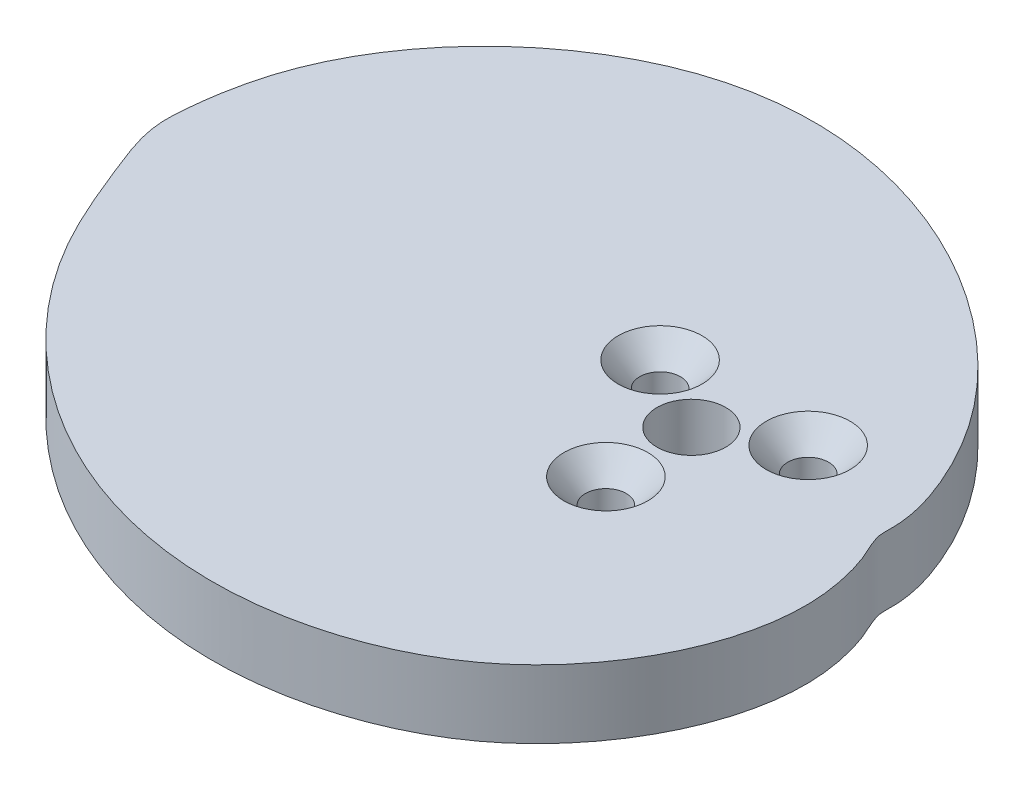
ISO-10303-21;
HEADER;
FILE_DESCRIPTION(('STEP AP214'),'2;1');
FILE_NAME('part.step','',(''),(''),'','','');
FILE_SCHEMA(('AUTOMOTIVE_DESIGN { 1 0 10303 214 1 1 1 1 }'));
ENDSEC;
DATA;
#1=APPLICATION_CONTEXT('core data for automotive mechanical design processes');
#2=APPLICATION_PROTOCOL_DEFINITION('international standard','automotive_design',2000,#1);
#3=PRODUCT_CONTEXT('',#1,'mechanical');
#4=PRODUCT('Part','Part','',(#3));
#5=PRODUCT_RELATED_PRODUCT_CATEGORY('part','',(#4));
#6=PRODUCT_DEFINITION_FORMATION('','',#4);
#7=PRODUCT_DEFINITION_CONTEXT('part definition',#1,'design');
#8=PRODUCT_DEFINITION('design','',#6,#7);
#9=PRODUCT_DEFINITION_SHAPE('','',#8);
#10=(LENGTH_UNIT() NAMED_UNIT(*) SI_UNIT(.MILLI.,.METRE.));
#11=(NAMED_UNIT(*) PLANE_ANGLE_UNIT() SI_UNIT($,.RADIAN.));
#12=(NAMED_UNIT(*) SI_UNIT($,.STERADIAN.) SOLID_ANGLE_UNIT());
#13=UNCERTAINTY_MEASURE_WITH_UNIT(LENGTH_MEASURE(1.E-05),#10,'distance_accuracy_value','');
#14=(GEOMETRIC_REPRESENTATION_CONTEXT(3) GLOBAL_UNCERTAINTY_ASSIGNED_CONTEXT((#13)) GLOBAL_UNIT_ASSIGNED_CONTEXT((#10,
#11,#12)) REPRESENTATION_CONTEXT('',''));
#15=CARTESIAN_POINT('',(0.,0.,0.));
#16=DIRECTION('',(0.,0.,1.));
#17=DIRECTION('',(1.,0.,0.));
#18=AXIS2_PLACEMENT_3D('',#15,#16,#17);
#19=CARTESIAN_POINT('',(-49.2125,3.175,0.));
#20=CARTESIAN_POINT('',(-49.1280004522732,3.175,1.90065792244172));
#21=CARTESIAN_POINT('',(-47.2540880933168,3.175,6.66413931437912));
#22=CARTESIAN_POINT('',(-42.8137329290288,3.175,17.6519170990426));
#23=CARTESIAN_POINT('',(-32.4859044128174,3.175,28.3387478991766));
#24=CARTESIAN_POINT('',(-19.3602400724952,3.175,33.9238641874124));
#25=CARTESIAN_POINT('',(-8.09712221959227,3.175,35.2466834780568));
#26=CARTESIAN_POINT('',(1.97885603914673,3.175,33.1837377459548));
#27=CARTESIAN_POINT('',(14.4173503802399,3.175,26.069147011578));
#28=CARTESIAN_POINT('',(20.8605641593018,3.175,13.8730576240785));
#29=CARTESIAN_POINT('',(19.2298151188731,3.175,4.80400336499832));
#30=CARTESIAN_POINT('',(18.5124860413441,3.175,2.55273845925311));
#31=CARTESIAN_POINT('',(17.8763525323498,3.175,1.26450673972017));
#32=CARTESIAN_POINT('',(17.3725445314869,3.175,-0.0262618883752947));
#33=CARTESIAN_POINT('',(17.5387463582876,3.175,-2.77335367017557));
#34=CARTESIAN_POINT('',(15.3191005053765,3.175,-10.0958942570277));
#35=CARTESIAN_POINT('',(4.81220487085529,3.175,-24.3071562403967));
#36=CARTESIAN_POINT('',(-14.6307156412061,3.175,-32.4629501155169));
#37=CARTESIAN_POINT('',(-35.6233493287113,3.175,-27.0074534795134));
#38=CARTESIAN_POINT('',(-46.9443759457376,3.175,-15.5950187741105));
#39=CARTESIAN_POINT('',(-49.0541571441806,3.175,-3.93180987345028));
#40=CARTESIAN_POINT('',(-49.2376521491179,3.175,-0.565750146284187));
#41=CARTESIAN_POINT('',(-49.2125,3.175,0.));
#42=B_SPLINE_CURVE_WITH_KNOTS('',3,(#19,#20,#21,#22,#23,#24,#25,#26,#27,#28,#29,#30,#31,#32,#33,
#34,#35,#36,#37,#38,#39,#40,#41),.UNSPECIFIED.,.T.,.F.,(4,1,1,1,1,1,1,1,1,1,1,1,1,1,1,1,1,1,1,1,
4),(0.,0.0279663967486096,0.0727600277481674,0.174313521559716,0.233184530112514,
0.278568108071313,0.338287208861123,0.379399608651692,0.487460722085829,0.506184645964242,
0.5132969846917,0.521874876340379,0.527253150289611,0.53321404670607,0.561507576476801,
0.636427649518343,0.787871295231716,0.828053444880665,0.951006716045295,0.991675517795837,1.),.UNSPECIFIED.);
#43=DIRECTION('',(0.,-1.,0.));
#44=VECTOR('',#43,1.);
#45=SURFACE_OF_LINEAR_EXTRUSION('',#42,#44);
#46=CARTESIAN_POINT('',(-49.2125,3.175,0.));
#47=VERTEX_POINT('',#46);
#48=EDGE_CURVE('E10',#47,#47,#42,.T.);
#49=ORIENTED_EDGE('',*,*,#48,.F.);
#50=EDGE_LOOP('',(#49));
#51=FACE_BOUND('',#50,.T.);
#52=CARTESIAN_POINT('',(-49.2125,-3.175,0.));
#53=CARTESIAN_POINT('',(-49.1280004522732,-3.175,1.90065792244172));
#54=CARTESIAN_POINT('',(-47.2540880933168,-3.175,6.66413931437912));
#55=CARTESIAN_POINT('',(-42.8137329290288,-3.175,17.6519170990426));
#56=CARTESIAN_POINT('',(-32.4859044128174,-3.175,28.3387478991766));
#57=CARTESIAN_POINT('',(-19.3602400724952,-3.175,33.9238641874124));
#58=CARTESIAN_POINT('',(-8.09712221959227,-3.175,35.2466834780568));
#59=CARTESIAN_POINT('',(1.97885603914673,-3.175,33.1837377459548));
#60=CARTESIAN_POINT('',(14.4173503802399,-3.175,26.069147011578));
#61=CARTESIAN_POINT('',(20.8605641593018,-3.175,13.8730576240785));
#62=CARTESIAN_POINT('',(19.2298151188731,-3.175,4.80400336499832));
#63=CARTESIAN_POINT('',(18.5124860413441,-3.175,2.55273845925311));
#64=CARTESIAN_POINT('',(17.8763525323498,-3.175,1.26450673972017));
#65=CARTESIAN_POINT('',(17.3725445314869,-3.175,-0.0262618883752947));
#66=CARTESIAN_POINT('',(17.5387463582876,-3.175,-2.77335367017557));
#67=CARTESIAN_POINT('',(15.3191005053765,-3.175,-10.0958942570277));
#68=CARTESIAN_POINT('',(4.81220487085529,-3.175,-24.3071562403967));
#69=CARTESIAN_POINT('',(-14.6307156412061,-3.175,-32.4629501155169));
#70=CARTESIAN_POINT('',(-35.6233493287113,-3.175,-27.0074534795134));
#71=CARTESIAN_POINT('',(-46.9443759457376,-3.175,-15.5950187741105));
#72=CARTESIAN_POINT('',(-49.0541571441806,-3.175,-3.93180987345028));
#73=CARTESIAN_POINT('',(-49.2376521491179,-3.175,-0.565750146284187));
#74=CARTESIAN_POINT('',(-49.2125,-3.175,0.));
#75=B_SPLINE_CURVE_WITH_KNOTS('',3,(#52,#53,#54,#55,#56,#57,#58,#59,#60,#61,#62,#63,#64,#65,#66,
#67,#68,#69,#70,#71,#72,#73,#74),.UNSPECIFIED.,.T.,.F.,(4,1,1,1,1,1,1,1,1,1,1,1,1,1,1,1,1,1,1,1,
4),(0.,0.0279663967486096,0.0727600277481674,0.174313521559716,0.233184530112514,
0.278568108071313,0.338287208861123,0.379399608651692,0.487460722085829,0.506184645964242,
0.5132969846917,0.521874876340379,0.527253150289611,0.53321404670607,0.561507576476801,
0.636427649518343,0.787871295231716,0.828053444880665,0.951006716045295,0.991675517795837,1.),.UNSPECIFIED.);
#76=CARTESIAN_POINT('',(-49.2125,-3.175,0.));
#77=VERTEX_POINT('',#76);
#78=EDGE_CURVE('E55',#77,#77,#75,.T.);
#79=ORIENTED_EDGE('',*,*,#78,.T.);
#80=EDGE_LOOP('',(#79));
#81=FACE_BOUND('',#80,.T.);
#82=ADVANCED_FACE('F51',(#51,#81),#45,.F.);
#83=CARTESIAN_POINT('',(19.2740141783279,3.175,5.28414083663297));
#84=DIRECTION('',(0.,1.,0.));
#85=DIRECTION('',(0.,0.,1.));
#86=AXIS2_PLACEMENT_3D('',#83,#84,#85);
#87=PLANE('',#86);
#88=CARTESIAN_POINT('',(0.,3.175,7.95020000000001));
#89=DIRECTION('',(0.,1.,0.));
#90=DIRECTION('',(0.,0.,1.));
#91=AXIS2_PLACEMENT_3D('',#88,#89,#90);
#92=CIRCLE('',#91,3.8989);
#93=CARTESIAN_POINT('',(0.,3.175,11.8491));
#94=VERTEX_POINT('',#93);
#95=EDGE_CURVE('E112',#94,#94,#92,.T.);
#96=ORIENTED_EDGE('',*,*,#95,.F.);
#97=EDGE_LOOP('',(#96));
#98=FACE_BOUND('',#97,.T.);
#99=CARTESIAN_POINT('',(6.88507516516696,3.175,-3.97510000000014));
#100=DIRECTION('',(0.,1.,0.));
#101=DIRECTION('',(0.,0.,1.));
#102=AXIS2_PLACEMENT_3D('',#99,#100,#101);
#103=CIRCLE('',#102,3.8989);
#104=CARTESIAN_POINT('',(6.88507516516696,3.175,-0.0762000000001425));
#105=VERTEX_POINT('',#104);
#106=EDGE_CURVE('E100',#105,#105,#103,.T.);
#107=ORIENTED_EDGE('',*,*,#106,.F.);
#108=EDGE_LOOP('',(#107));
#109=FACE_BOUND('',#108,.T.);
#110=CARTESIAN_POINT('',(-6.88507516516706,3.175,-3.97509999999996));
#111=DIRECTION('',(0.,1.,0.));
#112=DIRECTION('',(0.,0.,1.));
#113=AXIS2_PLACEMENT_3D('',#110,#111,#112);
#114=CIRCLE('',#113,3.8989);
#115=CARTESIAN_POINT('',(-6.88507516516706,3.175,-0.0761999999999634));
#116=VERTEX_POINT('',#115);
#117=EDGE_CURVE('E89',#116,#116,#114,.T.);
#118=ORIENTED_EDGE('',*,*,#117,.F.);
#119=EDGE_LOOP('',(#118));
#120=FACE_BOUND('',#119,.T.);
#121=CARTESIAN_POINT('',(0.,3.175,0.));
#122=DIRECTION('',(0.,1.,0.));
#123=DIRECTION('',(0.,0.,1.));
#124=AXIS2_PLACEMENT_3D('',#121,#122,#123);
#125=CIRCLE('',#124,3.2004);
#126=CARTESIAN_POINT('',(0.,3.175,3.2004));
#127=VERTEX_POINT('',#126);
#128=EDGE_CURVE('E77',#127,#127,#125,.T.);
#129=ORIENTED_EDGE('',*,*,#128,.F.);
#130=EDGE_LOOP('',(#129));
#131=FACE_BOUND('',#130,.T.);
#132=ORIENTED_EDGE('',*,*,#48,.T.);
#133=EDGE_LOOP('',(#132));
#134=FACE_BOUND('',#133,.T.);
#135=ADVANCED_FACE('F119',(#98,#109,#120,#131,#134),#87,.T.);
#136=CARTESIAN_POINT('',(19.2740141783279,-3.175,5.28414083663297));
#137=DIRECTION('',(0.,1.,0.));
#138=DIRECTION('',(0.,0.,1.));
#139=AXIS2_PLACEMENT_3D('',#136,#137,#138);
#140=PLANE('',#139);
#141=CARTESIAN_POINT('',(0.,-3.17500000000003,7.95020000000001));
#142=DIRECTION('',(0.,1.,0.));
#143=DIRECTION('',(0.,0.,1.));
#144=AXIS2_PLACEMENT_3D('',#141,#142,#143);
#145=CIRCLE('',#144,1.89865);
#146=CARTESIAN_POINT('',(0.,-3.17500000000003,9.84885000000001));
#147=VERTEX_POINT('',#146);
#148=EDGE_CURVE('E104',#147,#147,#145,.T.);
#149=ORIENTED_EDGE('',*,*,#148,.T.);
#150=EDGE_LOOP('',(#149));
#151=FACE_BOUND('',#150,.T.);
#152=CARTESIAN_POINT('',(6.88507516516696,-3.17500000000003,-3.97510000000014));
#153=DIRECTION('',(0.,1.,0.));
#154=DIRECTION('',(0.,0.,1.));
#155=AXIS2_PLACEMENT_3D('',#152,#153,#154);
#156=CIRCLE('',#155,1.89865);
#157=CARTESIAN_POINT('',(6.88507516516696,-3.17500000000003,-2.07645000000014));
#158=VERTEX_POINT('',#157);
#159=EDGE_CURVE('E93',#158,#158,#156,.T.);
#160=ORIENTED_EDGE('',*,*,#159,.T.);
#161=EDGE_LOOP('',(#160));
#162=FACE_BOUND('',#161,.T.);
#163=CARTESIAN_POINT('',(-6.88507516516706,-3.17500000000003,-3.97509999999996));
#164=DIRECTION('',(0.,1.,0.));
#165=DIRECTION('',(0.,0.,1.));
#166=AXIS2_PLACEMENT_3D('',#163,#164,#165);
#167=CIRCLE('',#166,1.89865);
#168=CARTESIAN_POINT('',(-6.88507516516706,-3.17500000000003,-2.07644999999997));
#169=VERTEX_POINT('',#168);
#170=EDGE_CURVE('E81',#169,#169,#167,.T.);
#171=ORIENTED_EDGE('',*,*,#170,.T.);
#172=EDGE_LOOP('',(#171));
#173=FACE_BOUND('',#172,.T.);
#174=CARTESIAN_POINT('',(0.,-3.175,0.));
#175=DIRECTION('',(0.,1.,0.));
#176=DIRECTION('',(0.,0.,1.));
#177=AXIS2_PLACEMENT_3D('',#174,#175,#176);
#178=CIRCLE('',#177,3.2004);
#179=CARTESIAN_POINT('',(0.,-3.175,3.2004));
#180=VERTEX_POINT('',#179);
#181=EDGE_CURVE('E66',#180,#180,#178,.T.);
#182=ORIENTED_EDGE('',*,*,#181,.T.);
#183=EDGE_LOOP('',(#182));
#184=FACE_BOUND('',#183,.T.);
#185=ORIENTED_EDGE('',*,*,#78,.F.);
#186=EDGE_LOOP('',(#185));
#187=FACE_BOUND('',#186,.T.);
#188=ADVANCED_FACE('F122',(#151,#162,#173,#184,#187),#140,.F.);
#189=CARTESIAN_POINT('',(0.,-3.175,0.));
#190=DIRECTION('',(0.,1.,0.));
#191=DIRECTION('',(0.,0.,1.));
#192=AXIS2_PLACEMENT_3D('',#189,#190,#191);
#193=CYLINDRICAL_SURFACE('',#192,3.2004);
#194=ORIENTED_EDGE('',*,*,#181,.F.);
#195=EDGE_LOOP('',(#194));
#196=FACE_BOUND('',#195,.T.);
#197=ORIENTED_EDGE('',*,*,#128,.T.);
#198=EDGE_LOOP('',(#197));
#199=FACE_BOUND('',#198,.T.);
#200=ADVANCED_FACE('F130',(#196,#199),#193,.F.);
#201=CARTESIAN_POINT('',(-6.88507516516706,3.175,-3.97509999999996));
#202=DIRECTION('',(0.,1.,0.));
#203=DIRECTION('',(0.,0.,1.));
#204=AXIS2_PLACEMENT_3D('',#201,#202,#203);
#205=CYLINDRICAL_SURFACE('',#204,1.89865);
#206=ORIENTED_EDGE('',*,*,#170,.F.);
#207=EDGE_LOOP('',(#206));
#208=FACE_BOUND('',#207,.T.);
#209=CARTESIAN_POINT('',(-6.88507516516706,0.873975593456175,-3.97509999999996));
#210=DIRECTION('',(0.,1.,0.));
#211=DIRECTION('',(0.,0.,1.));
#212=AXIS2_PLACEMENT_3D('',#209,#210,#211);
#213=CIRCLE('',#212,1.89865);
#214=CARTESIAN_POINT('',(-6.88507516516706,0.873975593456175,-2.07644999999997));
#215=VERTEX_POINT('',#214);
#216=EDGE_CURVE('E85',#215,#215,#213,.T.);
#217=ORIENTED_EDGE('',*,*,#216,.T.);
#218=EDGE_LOOP('',(#217));
#219=FACE_BOUND('',#218,.T.);
#220=ADVANCED_FACE('F132',(#208,#219),#205,.F.);
#221=CARTESIAN_POINT('',(-6.88507516516706,3.175,-3.97509999999996));
#222=DIRECTION('',(0.,1.,0.));
#223=DIRECTION('',(0.,0.,1.));
#224=AXIS2_PLACEMENT_3D('',#221,#222,#223);
#225=CONICAL_SURFACE('',#224,3.8989,0.715584993317676);
#226=ORIENTED_EDGE('',*,*,#216,.F.);
#227=EDGE_LOOP('',(#226));
#228=FACE_BOUND('',#227,.T.);
#229=ORIENTED_EDGE('',*,*,#117,.T.);
#230=EDGE_LOOP('',(#229));
#231=FACE_BOUND('',#230,.T.);
#232=ADVANCED_FACE('F139',(#228,#231),#225,.F.);
#233=CARTESIAN_POINT('',(6.88507516516696,3.175,-3.97510000000014));
#234=DIRECTION('',(0.,1.,0.));
#235=DIRECTION('',(0.,0.,1.));
#236=AXIS2_PLACEMENT_3D('',#233,#234,#235);
#237=CYLINDRICAL_SURFACE('',#236,1.89865);
#238=ORIENTED_EDGE('',*,*,#159,.F.);
#239=EDGE_LOOP('',(#238));
#240=FACE_BOUND('',#239,.T.);
#241=CARTESIAN_POINT('',(6.88507516516696,0.873975593456175,-3.97510000000014));
#242=DIRECTION('',(0.,1.,0.));
#243=DIRECTION('',(0.,0.,1.));
#244=AXIS2_PLACEMENT_3D('',#241,#242,#243);
#245=CIRCLE('',#244,1.89865);
#246=CARTESIAN_POINT('',(6.88507516516696,0.873975593456175,-2.07645000000014));
#247=VERTEX_POINT('',#246);
#248=EDGE_CURVE('E96',#247,#247,#245,.T.);
#249=ORIENTED_EDGE('',*,*,#248,.T.);
#250=EDGE_LOOP('',(#249));
#251=FACE_BOUND('',#250,.T.);
#252=ADVANCED_FACE('F169',(#240,#251),#237,.F.);
#253=CARTESIAN_POINT('',(6.88507516516696,3.175,-3.97510000000014));
#254=DIRECTION('',(0.,1.,0.));
#255=DIRECTION('',(0.,0.,1.));
#256=AXIS2_PLACEMENT_3D('',#253,#254,#255);
#257=CONICAL_SURFACE('',#256,3.8989,0.715584993317675);
#258=ORIENTED_EDGE('',*,*,#248,.F.);
#259=EDGE_LOOP('',(#258));
#260=FACE_BOUND('',#259,.T.);
#261=ORIENTED_EDGE('',*,*,#106,.T.);
#262=EDGE_LOOP('',(#261));
#263=FACE_BOUND('',#262,.T.);
#264=ADVANCED_FACE('F178',(#260,#263),#257,.F.);
#265=CARTESIAN_POINT('',(0.,3.175,7.95020000000001));
#266=DIRECTION('',(0.,1.,0.));
#267=DIRECTION('',(0.,0.,1.));
#268=AXIS2_PLACEMENT_3D('',#265,#266,#267);
#269=CYLINDRICAL_SURFACE('',#268,1.89865);
#270=ORIENTED_EDGE('',*,*,#148,.F.);
#271=EDGE_LOOP('',(#270));
#272=FACE_BOUND('',#271,.T.);
#273=CARTESIAN_POINT('',(0.,0.873975593456175,7.95020000000001));
#274=DIRECTION('',(0.,1.,0.));
#275=DIRECTION('',(0.,0.,1.));
#276=AXIS2_PLACEMENT_3D('',#273,#274,#275);
#277=CIRCLE('',#276,1.89865);
#278=CARTESIAN_POINT('',(0.,0.873975593456175,9.84885000000001));
#279=VERTEX_POINT('',#278);
#280=EDGE_CURVE('E108',#279,#279,#277,.T.);
#281=ORIENTED_EDGE('',*,*,#280,.T.);
#282=EDGE_LOOP('',(#281));
#283=FACE_BOUND('',#282,.T.);
#284=ADVANCED_FACE('F187',(#272,#283),#269,.F.);
#285=CARTESIAN_POINT('',(0.,3.175,7.95020000000001));
#286=DIRECTION('',(0.,1.,0.));
#287=DIRECTION('',(0.,0.,1.));
#288=AXIS2_PLACEMENT_3D('',#285,#286,#287);
#289=CONICAL_SURFACE('',#288,3.8989,0.715584993317675);
#290=ORIENTED_EDGE('',*,*,#280,.F.);
#291=EDGE_LOOP('',(#290));
#292=FACE_BOUND('',#291,.T.);
#293=ORIENTED_EDGE('',*,*,#95,.T.);
#294=EDGE_LOOP('',(#293));
#295=FACE_BOUND('',#294,.T.);
#296=ADVANCED_FACE('F117',(#292,#295),#289,.F.);
#297=CLOSED_SHELL('',(#82,#135,#188,#200,#220,#232,#252,#264,#284,#296));
#298=MANIFOLD_SOLID_BREP('B2',#297);
#299=ADVANCED_BREP_SHAPE_REPRESENTATION('',(#18,#298),#14);
#300=SHAPE_DEFINITION_REPRESENTATION(#9,#299);
ENDSEC;
END-ISO-10303-21;
